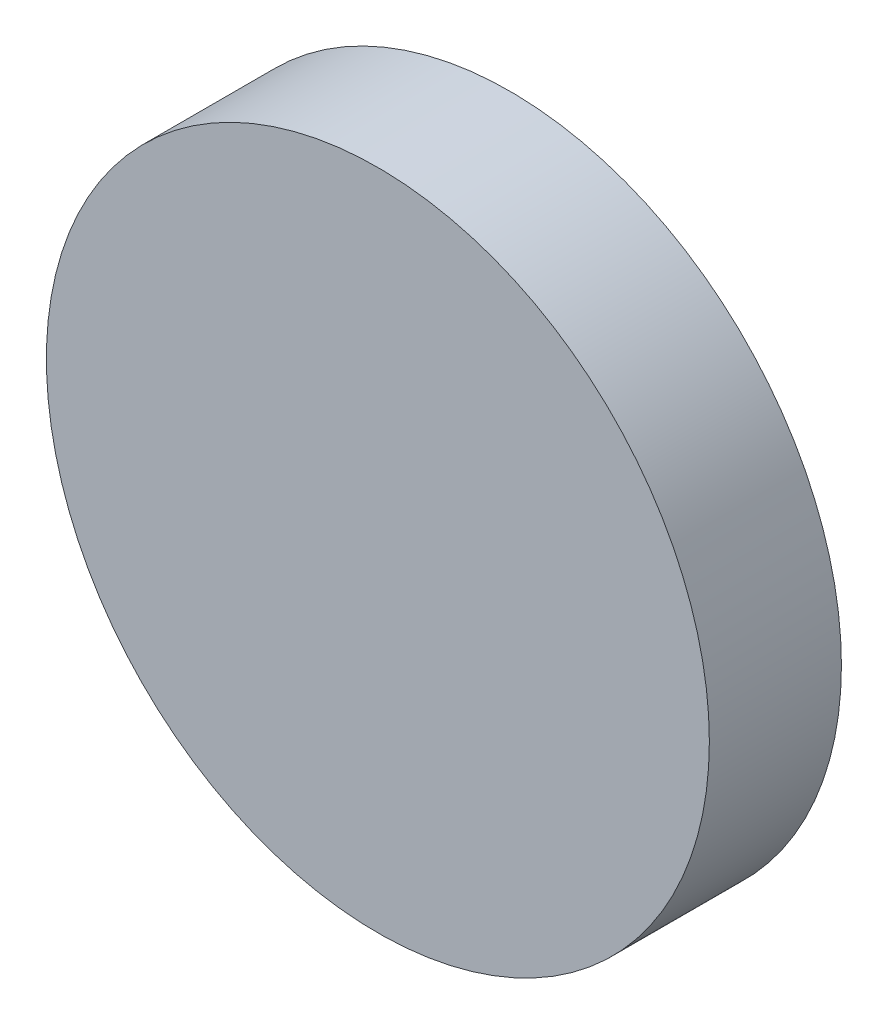
ISO-10303-21;
HEADER;
FILE_DESCRIPTION(('STEP AP214'),'2;1');
FILE_NAME('part.step','',(''),(''),'','','');
FILE_SCHEMA(('AUTOMOTIVE_DESIGN { 1 0 10303 214 1 1 1 1 }'));
ENDSEC;
DATA;
#1=APPLICATION_CONTEXT('core data for automotive mechanical design processes');
#2=APPLICATION_PROTOCOL_DEFINITION('international standard','automotive_design',2000,#1);
#3=PRODUCT_CONTEXT('',#1,'mechanical');
#4=PRODUCT('Part','Part','',(#3));
#5=PRODUCT_RELATED_PRODUCT_CATEGORY('part','',(#4));
#6=PRODUCT_DEFINITION_FORMATION('','',#4);
#7=PRODUCT_DEFINITION_CONTEXT('part definition',#1,'design');
#8=PRODUCT_DEFINITION('design','',#6,#7);
#9=PRODUCT_DEFINITION_SHAPE('','',#8);
#10=(LENGTH_UNIT() NAMED_UNIT(*) SI_UNIT(.MILLI.,.METRE.));
#11=(NAMED_UNIT(*) PLANE_ANGLE_UNIT() SI_UNIT($,.RADIAN.));
#12=(NAMED_UNIT(*) SI_UNIT($,.STERADIAN.) SOLID_ANGLE_UNIT());
#13=UNCERTAINTY_MEASURE_WITH_UNIT(LENGTH_MEASURE(1.E-05),#10,'distance_accuracy_value','');
#14=(GEOMETRIC_REPRESENTATION_CONTEXT(3) GLOBAL_UNCERTAINTY_ASSIGNED_CONTEXT((#13)) GLOBAL_UNIT_ASSIGNED_CONTEXT((#10,
#11,#12)) REPRESENTATION_CONTEXT('',''));
#15=CARTESIAN_POINT('',(0.,0.,0.));
#16=DIRECTION('',(0.,0.,1.));
#17=DIRECTION('',(1.,0.,0.));
#18=AXIS2_PLACEMENT_3D('',#15,#16,#17);
#19=CARTESIAN_POINT('',(-5.5808297200588,1.51147471584927,12.7));
#20=DIRECTION('',(0.,0.,-1.));
#21=DIRECTION('',(-1.,0.,0.));
#22=AXIS2_PLACEMENT_3D('',#19,#20,#21);
#23=CYLINDRICAL_SURFACE('',#22,31.8767496678224);
#24=CARTESIAN_POINT('',(-5.5808297200588,1.51147471584927,12.7));
#25=DIRECTION('',(0.,0.,1.));
#26=DIRECTION('',(1.,0.,0.));
#27=AXIS2_PLACEMENT_3D('',#24,#25,#26);
#28=CIRCLE('',#27,31.8767496678224);
#29=CARTESIAN_POINT('',(26.2959199477636,1.51147471584927,12.7));
#30=VERTEX_POINT('',#29);
#31=EDGE_CURVE('E10',#30,#30,#28,.T.);
#32=ORIENTED_EDGE('',*,*,#31,.F.);
#33=EDGE_LOOP('',(#32));
#34=FACE_BOUND('',#33,.T.);
#35=CARTESIAN_POINT('',(-5.5808297200588,1.51147471584927,0.));
#36=DIRECTION('',(0.,0.,1.));
#37=DIRECTION('',(1.,0.,0.));
#38=AXIS2_PLACEMENT_3D('',#35,#36,#37);
#39=CIRCLE('',#38,31.8767496678224);
#40=CARTESIAN_POINT('',(26.2959199477636,1.51147471584927,0.));
#41=VERTEX_POINT('',#40);
#42=EDGE_CURVE('E34',#41,#41,#39,.T.);
#43=ORIENTED_EDGE('',*,*,#42,.T.);
#44=EDGE_LOOP('',(#43));
#45=FACE_BOUND('',#44,.T.);
#46=ADVANCED_FACE('F31',(#34,#45),#23,.T.);
#47=CARTESIAN_POINT('',(-5.5808297200588,1.51147471584927,12.7));
#48=DIRECTION('',(0.,0.,1.));
#49=DIRECTION('',(1.,0.,0.));
#50=AXIS2_PLACEMENT_3D('',#47,#48,#49);
#51=PLANE('',#50);
#52=ORIENTED_EDGE('',*,*,#31,.T.);
#53=EDGE_LOOP('',(#52));
#54=FACE_BOUND('',#53,.T.);
#55=ADVANCED_FACE('F46',(#54),#51,.T.);
#56=CARTESIAN_POINT('',(-5.5808297200588,1.51147471584927,0.));
#57=DIRECTION('',(0.,0.,1.));
#58=DIRECTION('',(1.,0.,0.));
#59=AXIS2_PLACEMENT_3D('',#56,#57,#58);
#60=PLANE('',#59);
#61=ORIENTED_EDGE('',*,*,#42,.F.);
#62=EDGE_LOOP('',(#61));
#63=FACE_BOUND('',#62,.T.);
#64=ADVANCED_FACE('F44',(#63),#60,.F.);
#65=CLOSED_SHELL('',(#46,#55,#64));
#66=MANIFOLD_SOLID_BREP('B2',#65);
#67=ADVANCED_BREP_SHAPE_REPRESENTATION('',(#18,#66),#14);
#68=SHAPE_DEFINITION_REPRESENTATION(#9,#67);
ENDSEC;
END-ISO-10303-21;
